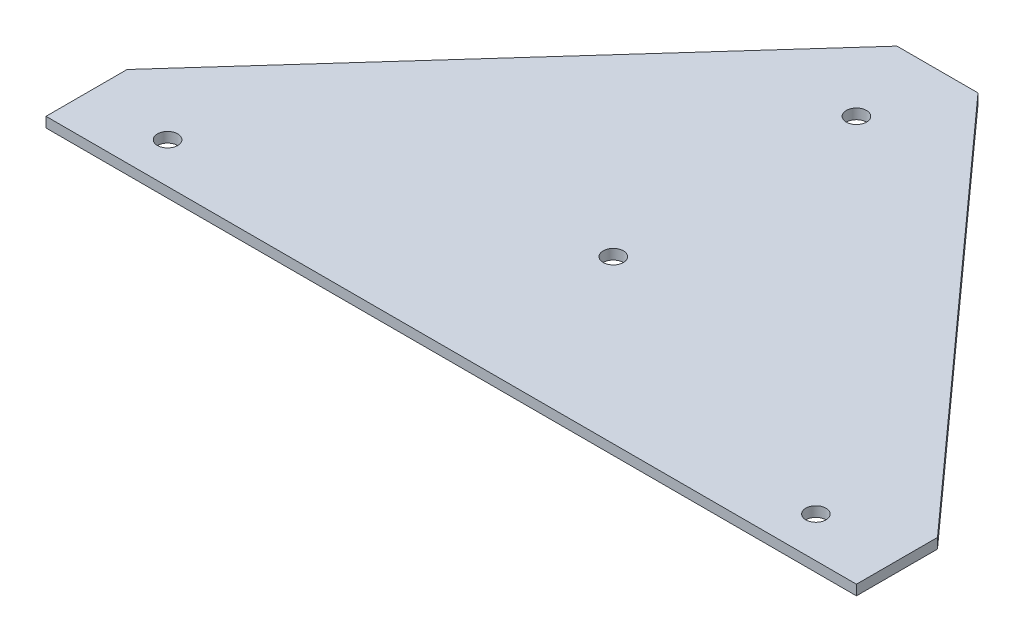
ISO-10303-21;
HEADER;
FILE_DESCRIPTION(('STEP AP214'),'2;1');
FILE_NAME('part.step','',(''),(''),'','','');
FILE_SCHEMA(('AUTOMOTIVE_DESIGN { 1 0 10303 214 1 1 1 1 }'));
ENDSEC;
DATA;
#1=APPLICATION_CONTEXT('core data for automotive mechanical design processes');
#2=APPLICATION_PROTOCOL_DEFINITION('international standard','automotive_design',2000,#1);
#3=PRODUCT_CONTEXT('',#1,'mechanical');
#4=PRODUCT('Part','Part','',(#3));
#5=PRODUCT_RELATED_PRODUCT_CATEGORY('part','',(#4));
#6=PRODUCT_DEFINITION_FORMATION('','',#4);
#7=PRODUCT_DEFINITION_CONTEXT('part definition',#1,'design');
#8=PRODUCT_DEFINITION('design','',#6,#7);
#9=PRODUCT_DEFINITION_SHAPE('','',#8);
#10=(LENGTH_UNIT() NAMED_UNIT(*) SI_UNIT(.MILLI.,.METRE.));
#11=(NAMED_UNIT(*) PLANE_ANGLE_UNIT() SI_UNIT($,.RADIAN.));
#12=(NAMED_UNIT(*) SI_UNIT($,.STERADIAN.) SOLID_ANGLE_UNIT());
#13=UNCERTAINTY_MEASURE_WITH_UNIT(LENGTH_MEASURE(1.E-05),#10,'distance_accuracy_value','');
#14=(GEOMETRIC_REPRESENTATION_CONTEXT(3) GLOBAL_UNCERTAINTY_ASSIGNED_CONTEXT((#13)) GLOBAL_UNIT_ASSIGNED_CONTEXT((#10,
#11,#12)) REPRESENTATION_CONTEXT('',''));
#15=CARTESIAN_POINT('',(0.,0.,0.));
#16=DIRECTION('',(0.,0.,1.));
#17=DIRECTION('',(1.,0.,0.));
#18=AXIS2_PLACEMENT_3D('',#15,#16,#17);
#19=CARTESIAN_POINT('',(0.,3.175,0.));
#20=DIRECTION('',(0.,-1.,0.));
#21=DIRECTION('',(0.,0.,-1.));
#22=AXIS2_PLACEMENT_3D('',#19,#20,#21);
#23=PLANE('',#22);
#24=DIRECTION('',(0.,0.,1.));
#25=VECTOR('',#24,1.);
#26=CARTESIAN_POINT('',(-127.,3.175,0.));
#27=LINE('',#26,#25);
#28=CARTESIAN_POINT('',(-127.,3.175,-25.4));
#29=VERTEX_POINT('',#28);
#30=CARTESIAN_POINT('',(-127.,3.175,0.));
#31=VERTEX_POINT('',#30);
#32=EDGE_CURVE('E129',#29,#31,#27,.T.);
#33=ORIENTED_EDGE('',*,*,#32,.T.);
#34=DIRECTION('',(1.,0.,0.));
#35=VECTOR('',#34,1.);
#36=CARTESIAN_POINT('',(127.,3.175,0.));
#37=LINE('',#36,#35);
#38=CARTESIAN_POINT('',(127.,3.175,0.));
#39=VERTEX_POINT('',#38);
#40=EDGE_CURVE('E87',#31,#39,#37,.T.);
#41=ORIENTED_EDGE('',*,*,#40,.T.);
#42=DIRECTION('',(0.,0.,-1.));
#43=VECTOR('',#42,1.);
#44=CARTESIAN_POINT('',(127.,3.175,0.));
#45=LINE('',#44,#43);
#46=CARTESIAN_POINT('',(127.,3.175,-25.4));
#47=VERTEX_POINT('',#46);
#48=EDGE_CURVE('E100',#39,#47,#45,.T.);
#49=ORIENTED_EDGE('',*,*,#48,.T.);
#50=DIRECTION('',(-0.66896473162245,0.,-0.743294146247166));
#51=VECTOR('',#50,1.);
#52=CARTESIAN_POINT('',(127.,3.175,-25.4));
#53=LINE('',#52,#51);
#54=CARTESIAN_POINT('',(12.7,3.175,-152.4));
#55=VERTEX_POINT('',#54);
#56=EDGE_CURVE('E94',#47,#55,#53,.T.);
#57=ORIENTED_EDGE('',*,*,#56,.T.);
#58=DIRECTION('',(-1.,0.,0.));
#59=VECTOR('',#58,1.);
#60=CARTESIAN_POINT('',(-12.7,3.175,-152.4));
#61=LINE('',#60,#59);
#62=CARTESIAN_POINT('',(-12.7,3.175,-152.4));
#63=VERTEX_POINT('',#62);
#64=EDGE_CURVE('E98',#55,#63,#61,.T.);
#65=ORIENTED_EDGE('',*,*,#64,.T.);
#66=DIRECTION('',(-0.66896473162245,0.,0.743294146247166));
#67=VECTOR('',#66,1.);
#68=CARTESIAN_POINT('',(-127.,3.175,-25.4));
#69=LINE('',#68,#67);
#70=EDGE_CURVE('E50',#63,#29,#69,.T.);
#71=ORIENTED_EDGE('',*,*,#70,.T.);
#72=EDGE_LOOP('',(#33,#41,#49,#57,#65,#71));
#73=FACE_BOUND('',#72,.T.);
#74=CARTESIAN_POINT('',(0.,3.175,-127.));
#75=DIRECTION('',(0.,1.,0.));
#76=DIRECTION('',(0.,0.,1.));
#77=AXIS2_PLACEMENT_3D('',#74,#75,#76);
#78=CIRCLE('',#77,3.175);
#79=CARTESIAN_POINT('',(0.,3.175,-123.825));
#80=VERTEX_POINT('',#79);
#81=EDGE_CURVE('E122',#80,#80,#78,.T.);
#82=ORIENTED_EDGE('',*,*,#81,.F.);
#83=EDGE_LOOP('',(#82));
#84=FACE_BOUND('',#83,.T.);
#85=CARTESIAN_POINT('',(0.,3.175,-50.8));
#86=DIRECTION('',(0.,1.,0.));
#87=DIRECTION('',(0.,0.,1.));
#88=AXIS2_PLACEMENT_3D('',#85,#86,#87);
#89=CIRCLE('',#88,3.175);
#90=CARTESIAN_POINT('',(0.,3.175,-47.625));
#91=VERTEX_POINT('',#90);
#92=EDGE_CURVE('E193',#91,#91,#89,.T.);
#93=ORIENTED_EDGE('',*,*,#92,.F.);
#94=EDGE_LOOP('',(#93));
#95=FACE_BOUND('',#94,.T.);
#96=CARTESIAN_POINT('',(-101.6,3.175,-12.7));
#97=DIRECTION('',(0.,1.,0.));
#98=DIRECTION('',(0.,0.,1.));
#99=AXIS2_PLACEMENT_3D('',#96,#97,#98);
#100=CIRCLE('',#99,3.175);
#101=CARTESIAN_POINT('',(-101.6,3.175,-9.52499999999997));
#102=VERTEX_POINT('',#101);
#103=EDGE_CURVE('E187',#102,#102,#100,.T.);
#104=ORIENTED_EDGE('',*,*,#103,.F.);
#105=EDGE_LOOP('',(#104));
#106=FACE_BOUND('',#105,.T.);
#107=CARTESIAN_POINT('',(101.6,3.175,-12.7));
#108=DIRECTION('',(0.,1.,0.));
#109=DIRECTION('',(0.,0.,-1.));
#110=AXIS2_PLACEMENT_3D('',#107,#108,#109);
#111=CIRCLE('',#110,3.175);
#112=CARTESIAN_POINT('',(101.6,3.175,-15.875));
#113=VERTEX_POINT('',#112);
#114=EDGE_CURVE('E178',#113,#113,#111,.T.);
#115=ORIENTED_EDGE('',*,*,#114,.F.);
#116=EDGE_LOOP('',(#115));
#117=FACE_BOUND('',#116,.T.);
#118=ADVANCED_FACE('F33',(#73,#84,#95,#106,#117),#23,.F.);
#119=CARTESIAN_POINT('',(0.,0.,0.));
#120=DIRECTION('',(0.,-1.,0.));
#121=DIRECTION('',(0.,0.,-1.));
#122=AXIS2_PLACEMENT_3D('',#119,#120,#121);
#123=PLANE('',#122);
#124=CARTESIAN_POINT('',(-101.6,0.,-12.7));
#125=DIRECTION('',(0.,1.,0.));
#126=DIRECTION('',(0.,0.,1.));
#127=AXIS2_PLACEMENT_3D('',#124,#125,#126);
#128=CIRCLE('',#127,3.175);
#129=CARTESIAN_POINT('',(-101.6,0.,-9.52499999999997));
#130=VERTEX_POINT('',#129);
#131=EDGE_CURVE('E184',#130,#130,#128,.T.);
#132=ORIENTED_EDGE('',*,*,#131,.T.);
#133=EDGE_LOOP('',(#132));
#134=FACE_BOUND('',#133,.T.);
#135=CARTESIAN_POINT('',(0.,0.,-127.));
#136=DIRECTION('',(0.,1.,0.));
#137=DIRECTION('',(0.,0.,1.));
#138=AXIS2_PLACEMENT_3D('',#135,#136,#137);
#139=CIRCLE('',#138,3.175);
#140=CARTESIAN_POINT('',(0.,0.,-123.825));
#141=VERTEX_POINT('',#140);
#142=EDGE_CURVE('E196',#141,#141,#139,.T.);
#143=ORIENTED_EDGE('',*,*,#142,.T.);
#144=EDGE_LOOP('',(#143));
#145=FACE_BOUND('',#144,.T.);
#146=DIRECTION('',(0.,0.,1.));
#147=VECTOR('',#146,1.);
#148=CARTESIAN_POINT('',(-127.,0.,0.));
#149=LINE('',#148,#147);
#150=CARTESIAN_POINT('',(-127.,0.,-25.4));
#151=VERTEX_POINT('',#150);
#152=CARTESIAN_POINT('',(-127.,0.,0.));
#153=VERTEX_POINT('',#152);
#154=EDGE_CURVE('E118',#151,#153,#149,.T.);
#155=ORIENTED_EDGE('',*,*,#154,.F.);
#156=DIRECTION('',(-0.66896473162245,0.,0.743294146247166));
#157=VECTOR('',#156,1.);
#158=CARTESIAN_POINT('',(-127.,0.,-25.4));
#159=LINE('',#158,#157);
#160=CARTESIAN_POINT('',(-12.7,0.,-152.4));
#161=VERTEX_POINT('',#160);
#162=EDGE_CURVE('E79',#161,#151,#159,.T.);
#163=ORIENTED_EDGE('',*,*,#162,.F.);
#164=DIRECTION('',(-1.,0.,0.));
#165=VECTOR('',#164,1.);
#166=CARTESIAN_POINT('',(-12.7,0.,-152.4));
#167=LINE('',#166,#165);
#168=CARTESIAN_POINT('',(12.7,0.,-152.4));
#169=VERTEX_POINT('',#168);
#170=EDGE_CURVE('E73',#169,#161,#167,.T.);
#171=ORIENTED_EDGE('',*,*,#170,.F.);
#172=DIRECTION('',(-0.66896473162245,0.,-0.743294146247166));
#173=VECTOR('',#172,1.);
#174=CARTESIAN_POINT('',(127.,0.,-25.4));
#175=LINE('',#174,#173);
#176=CARTESIAN_POINT('',(127.,0.,-25.4));
#177=VERTEX_POINT('',#176);
#178=EDGE_CURVE('E108',#177,#169,#175,.T.);
#179=ORIENTED_EDGE('',*,*,#178,.F.);
#180=DIRECTION('',(0.,0.,-1.));
#181=VECTOR('',#180,1.);
#182=CARTESIAN_POINT('',(127.,0.,0.));
#183=LINE('',#182,#181);
#184=CARTESIAN_POINT('',(127.,0.,0.));
#185=VERTEX_POINT('',#184);
#186=EDGE_CURVE('E124',#185,#177,#183,.T.);
#187=ORIENTED_EDGE('',*,*,#186,.F.);
#188=DIRECTION('',(1.,0.,0.));
#189=VECTOR('',#188,1.);
#190=CARTESIAN_POINT('',(127.,0.,0.));
#191=LINE('',#190,#189);
#192=EDGE_CURVE('E121',#153,#185,#191,.T.);
#193=ORIENTED_EDGE('',*,*,#192,.F.);
#194=EDGE_LOOP('',(#155,#163,#171,#179,#187,#193));
#195=FACE_BOUND('',#194,.T.);
#196=CARTESIAN_POINT('',(0.,0.,-50.8));
#197=DIRECTION('',(0.,1.,0.));
#198=DIRECTION('',(0.,0.,1.));
#199=AXIS2_PLACEMENT_3D('',#196,#197,#198);
#200=CIRCLE('',#199,3.175);
#201=CARTESIAN_POINT('',(0.,0.,-47.625));
#202=VERTEX_POINT('',#201);
#203=EDGE_CURVE('E190',#202,#202,#200,.T.);
#204=ORIENTED_EDGE('',*,*,#203,.T.);
#205=EDGE_LOOP('',(#204));
#206=FACE_BOUND('',#205,.T.);
#207=CARTESIAN_POINT('',(101.6,0.,-12.7));
#208=DIRECTION('',(0.,1.,0.));
#209=DIRECTION('',(0.,0.,-1.));
#210=AXIS2_PLACEMENT_3D('',#207,#208,#209);
#211=CIRCLE('',#210,3.175);
#212=CARTESIAN_POINT('',(101.6,0.,-15.875));
#213=VERTEX_POINT('',#212);
#214=EDGE_CURVE('E181',#213,#213,#211,.T.);
#215=ORIENTED_EDGE('',*,*,#214,.T.);
#216=EDGE_LOOP('',(#215));
#217=FACE_BOUND('',#216,.T.);
#218=ADVANCED_FACE('F138',(#134,#145,#195,#206,#217),#123,.T.);
#219=CARTESIAN_POINT('',(-127.,3.175,0.));
#220=DIRECTION('',(1.,0.,0.));
#221=DIRECTION('',(0.,0.,-1.));
#222=AXIS2_PLACEMENT_3D('',#219,#220,#221);
#223=PLANE('',#222);
#224=ORIENTED_EDGE('',*,*,#154,.T.);
#225=DIRECTION('',(0.,-1.,0.));
#226=VECTOR('',#225,1.);
#227=CARTESIAN_POINT('',(-127.,3.175,0.));
#228=LINE('',#227,#226);
#229=EDGE_CURVE('E11',#31,#153,#228,.T.);
#230=ORIENTED_EDGE('',*,*,#229,.F.);
#231=ORIENTED_EDGE('',*,*,#32,.F.);
#232=DIRECTION('',(0.,-1.,0.));
#233=VECTOR('',#232,1.);
#234=CARTESIAN_POINT('',(-127.,3.175,-25.4));
#235=LINE('',#234,#233);
#236=EDGE_CURVE('E114',#29,#151,#235,.T.);
#237=ORIENTED_EDGE('',*,*,#236,.T.);
#238=EDGE_LOOP('',(#224,#230,#231,#237));
#239=FACE_BOUND('',#238,.T.);
#240=ADVANCED_FACE('F35',(#239),#223,.F.);
#241=CARTESIAN_POINT('',(127.,3.175,0.));
#242=DIRECTION('',(0.,0.,-1.));
#243=DIRECTION('',(-1.,0.,0.));
#244=AXIS2_PLACEMENT_3D('',#241,#242,#243);
#245=PLANE('',#244);
#246=ORIENTED_EDGE('',*,*,#192,.T.);
#247=DIRECTION('',(0.,-1.,0.));
#248=VECTOR('',#247,1.);
#249=CARTESIAN_POINT('',(127.,3.175,0.));
#250=LINE('',#249,#248);
#251=EDGE_CURVE('E42',#39,#185,#250,.T.);
#252=ORIENTED_EDGE('',*,*,#251,.F.);
#253=ORIENTED_EDGE('',*,*,#40,.F.);
#254=ORIENTED_EDGE('',*,*,#229,.T.);
#255=EDGE_LOOP('',(#246,#252,#253,#254));
#256=FACE_BOUND('',#255,.T.);
#257=ADVANCED_FACE('F256',(#256),#245,.F.);
#258=CARTESIAN_POINT('',(127.,3.175,0.));
#259=DIRECTION('',(-1.,0.,0.));
#260=DIRECTION('',(0.,0.,1.));
#261=AXIS2_PLACEMENT_3D('',#258,#259,#260);
#262=PLANE('',#261);
#263=ORIENTED_EDGE('',*,*,#186,.T.);
#264=DIRECTION('',(0.,-1.,0.));
#265=VECTOR('',#264,1.);
#266=CARTESIAN_POINT('',(127.,3.175,-25.4));
#267=LINE('',#266,#265);
#268=EDGE_CURVE('E109',#47,#177,#267,.T.);
#269=ORIENTED_EDGE('',*,*,#268,.F.);
#270=ORIENTED_EDGE('',*,*,#48,.F.);
#271=ORIENTED_EDGE('',*,*,#251,.T.);
#272=EDGE_LOOP('',(#263,#269,#270,#271));
#273=FACE_BOUND('',#272,.T.);
#274=ADVANCED_FACE('F135',(#273),#262,.F.);
#275=CARTESIAN_POINT('',(127.,3.175,-25.4));
#276=DIRECTION('',(-0.743294146247166,0.,0.66896473162245));
#277=DIRECTION('',(0.66896473162245,0.,0.743294146247166));
#278=AXIS2_PLACEMENT_3D('',#275,#276,#277);
#279=PLANE('',#278);
#280=ORIENTED_EDGE('',*,*,#178,.T.);
#281=DIRECTION('',(0.,-1.,0.));
#282=VECTOR('',#281,1.);
#283=CARTESIAN_POINT('',(12.7,3.175,-152.4));
#284=LINE('',#283,#282);
#285=EDGE_CURVE('E105',#55,#169,#284,.T.);
#286=ORIENTED_EDGE('',*,*,#285,.F.);
#287=ORIENTED_EDGE('',*,*,#56,.F.);
#288=ORIENTED_EDGE('',*,*,#268,.T.);
#289=EDGE_LOOP('',(#280,#286,#287,#288));
#290=FACE_BOUND('',#289,.T.);
#291=ADVANCED_FACE('F106',(#290),#279,.F.);
#292=CARTESIAN_POINT('',(-12.7,3.175,-152.4));
#293=DIRECTION('',(0.,0.,1.));
#294=DIRECTION('',(1.,0.,0.));
#295=AXIS2_PLACEMENT_3D('',#292,#293,#294);
#296=PLANE('',#295);
#297=ORIENTED_EDGE('',*,*,#170,.T.);
#298=DIRECTION('',(0.,-1.,0.));
#299=VECTOR('',#298,1.);
#300=CARTESIAN_POINT('',(-12.7,3.175,-152.4));
#301=LINE('',#300,#299);
#302=EDGE_CURVE('E110',#63,#161,#301,.T.);
#303=ORIENTED_EDGE('',*,*,#302,.F.);
#304=ORIENTED_EDGE('',*,*,#64,.F.);
#305=ORIENTED_EDGE('',*,*,#285,.T.);
#306=EDGE_LOOP('',(#297,#303,#304,#305));
#307=FACE_BOUND('',#306,.T.);
#308=ADVANCED_FACE('F112',(#307),#296,.F.);
#309=CARTESIAN_POINT('',(-127.,3.175,-25.4));
#310=DIRECTION('',(0.743294146247166,0.,0.66896473162245));
#311=DIRECTION('',(0.66896473162245,0.,-0.743294146247166));
#312=AXIS2_PLACEMENT_3D('',#309,#310,#311);
#313=PLANE('',#312);
#314=ORIENTED_EDGE('',*,*,#162,.T.);
#315=ORIENTED_EDGE('',*,*,#236,.F.);
#316=ORIENTED_EDGE('',*,*,#70,.F.);
#317=ORIENTED_EDGE('',*,*,#302,.T.);
#318=EDGE_LOOP('',(#314,#315,#316,#317));
#319=FACE_BOUND('',#318,.T.);
#320=ADVANCED_FACE('F143',(#319),#313,.F.);
#321=CARTESIAN_POINT('',(0.,3.175,-127.));
#322=DIRECTION('',(0.,-1.,0.));
#323=DIRECTION('',(0.,0.,-1.));
#324=AXIS2_PLACEMENT_3D('',#321,#322,#323);
#325=CYLINDRICAL_SURFACE('',#324,3.175);
#326=ORIENTED_EDGE('',*,*,#81,.T.);
#327=EDGE_LOOP('',(#326));
#328=FACE_BOUND('',#327,.T.);
#329=ORIENTED_EDGE('',*,*,#142,.F.);
#330=EDGE_LOOP('',(#329));
#331=FACE_BOUND('',#330,.T.);
#332=ADVANCED_FACE('F145',(#328,#331),#325,.F.);
#333=CARTESIAN_POINT('',(0.,3.175,-50.8));
#334=DIRECTION('',(0.,-1.,0.));
#335=DIRECTION('',(0.,0.,-1.));
#336=AXIS2_PLACEMENT_3D('',#333,#334,#335);
#337=CYLINDRICAL_SURFACE('',#336,3.175);
#338=ORIENTED_EDGE('',*,*,#92,.T.);
#339=EDGE_LOOP('',(#338));
#340=FACE_BOUND('',#339,.T.);
#341=ORIENTED_EDGE('',*,*,#203,.F.);
#342=EDGE_LOOP('',(#341));
#343=FACE_BOUND('',#342,.T.);
#344=ADVANCED_FACE('F151',(#340,#343),#337,.F.);
#345=CARTESIAN_POINT('',(-101.6,3.175,-12.7));
#346=DIRECTION('',(0.,-1.,0.));
#347=DIRECTION('',(0.,0.,-1.));
#348=AXIS2_PLACEMENT_3D('',#345,#346,#347);
#349=CYLINDRICAL_SURFACE('',#348,3.175);
#350=ORIENTED_EDGE('',*,*,#103,.T.);
#351=EDGE_LOOP('',(#350));
#352=FACE_BOUND('',#351,.T.);
#353=ORIENTED_EDGE('',*,*,#131,.F.);
#354=EDGE_LOOP('',(#353));
#355=FACE_BOUND('',#354,.T.);
#356=ADVANCED_FACE('F165',(#352,#355),#349,.F.);
#357=CARTESIAN_POINT('',(101.6,3.175,-12.7));
#358=DIRECTION('',(0.,-1.,0.));
#359=DIRECTION('',(0.,0.,-1.));
#360=AXIS2_PLACEMENT_3D('',#357,#358,#359);
#361=CYLINDRICAL_SURFACE('',#360,3.175);
#362=ORIENTED_EDGE('',*,*,#114,.T.);
#363=EDGE_LOOP('',(#362));
#364=FACE_BOUND('',#363,.T.);
#365=ORIENTED_EDGE('',*,*,#214,.F.);
#366=EDGE_LOOP('',(#365));
#367=FACE_BOUND('',#366,.T.);
#368=ADVANCED_FACE('F169',(#364,#367),#361,.F.);
#369=CLOSED_SHELL('',(#118,#218,#240,#257,#274,#291,#308,#320,#332,#344,#356,#368));
#370=MANIFOLD_SOLID_BREP('B2',#369);
#371=ADVANCED_BREP_SHAPE_REPRESENTATION('',(#18,#370),#14);
#372=SHAPE_DEFINITION_REPRESENTATION(#9,#371);
ENDSEC;
END-ISO-10303-21;
